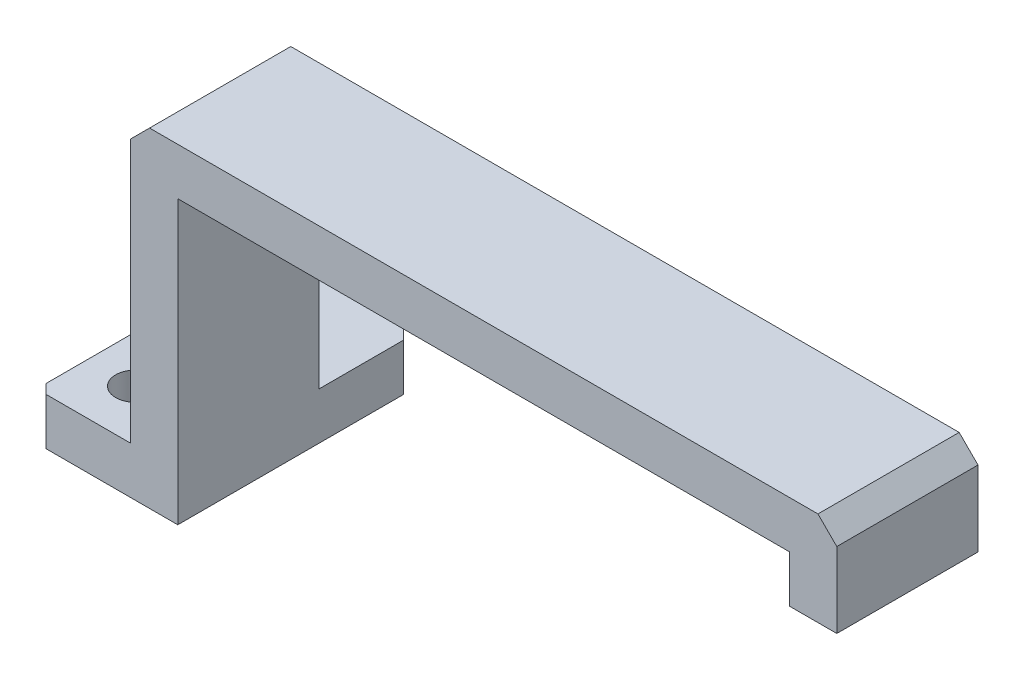
ISO-10303-21;
HEADER;
FILE_DESCRIPTION(('STEP AP214'),'2;1');
FILE_NAME('part.step','',(''),(''),'','','');
FILE_SCHEMA(('AUTOMOTIVE_DESIGN { 1 0 10303 214 1 1 1 1 }'));
ENDSEC;
DATA;
#1=APPLICATION_CONTEXT('core data for automotive mechanical design processes');
#2=APPLICATION_PROTOCOL_DEFINITION('international standard','automotive_design',2000,#1);
#3=PRODUCT_CONTEXT('',#1,'mechanical');
#4=PRODUCT('Part','Part','',(#3));
#5=PRODUCT_RELATED_PRODUCT_CATEGORY('part','',(#4));
#6=PRODUCT_DEFINITION_FORMATION('','',#4);
#7=PRODUCT_DEFINITION_CONTEXT('part definition',#1,'design');
#8=PRODUCT_DEFINITION('design','',#6,#7);
#9=PRODUCT_DEFINITION_SHAPE('','',#8);
#10=(LENGTH_UNIT() NAMED_UNIT(*) SI_UNIT(.MILLI.,.METRE.));
#11=(NAMED_UNIT(*) PLANE_ANGLE_UNIT() SI_UNIT($,.RADIAN.));
#12=(NAMED_UNIT(*) SI_UNIT($,.STERADIAN.) SOLID_ANGLE_UNIT());
#13=UNCERTAINTY_MEASURE_WITH_UNIT(LENGTH_MEASURE(1.E-05),#10,'distance_accuracy_value','');
#14=(GEOMETRIC_REPRESENTATION_CONTEXT(3) GLOBAL_UNCERTAINTY_ASSIGNED_CONTEXT((#13)) GLOBAL_UNIT_ASSIGNED_CONTEXT((#10,
#11,#12)) REPRESENTATION_CONTEXT('',''));
#15=CARTESIAN_POINT('',(0.,0.,0.));
#16=DIRECTION('',(0.,0.,1.));
#17=DIRECTION('',(1.,0.,0.));
#18=AXIS2_PLACEMENT_3D('',#15,#16,#17);
#19=CARTESIAN_POINT('',(0.,0.,0.));
#20=DIRECTION('',(0.,0.,1.));
#21=DIRECTION('',(1.,0.,0.));
#22=AXIS2_PLACEMENT_3D('',#19,#20,#21);
#23=PLANE('',#22);
#24=DIRECTION('',(-1.,0.,0.));
#25=VECTOR('',#24,1.);
#26=CARTESIAN_POINT('',(-21.3196601125011,-12.5,0.));
#27=LINE('',#26,#25);
#28=CARTESIAN_POINT('',(-32.5,-12.5,0.));
#29=VERTEX_POINT('',#28);
#30=CARTESIAN_POINT('',(-37.5,-12.5,0.));
#31=VERTEX_POINT('',#30);
#32=EDGE_CURVE('E156',#29,#31,#27,.T.);
#33=ORIENTED_EDGE('',*,*,#32,.T.);
#34=DIRECTION('',(0.,1.,0.));
#35=VECTOR('',#34,1.);
#36=CARTESIAN_POINT('',(-37.5,0.,0.));
#37=LINE('',#36,#35);
#38=CARTESIAN_POINT('',(-37.5,15.5,0.));
#39=VERTEX_POINT('',#38);
#40=EDGE_CURVE('E159',#31,#39,#37,.T.);
#41=ORIENTED_EDGE('',*,*,#40,.T.);
#42=DIRECTION('',(-0.707106781186546,-0.707106781186549,0.));
#43=VECTOR('',#42,1.);
#44=CARTESIAN_POINT('',(-37.5,15.5,0.));
#45=LINE('',#44,#43);
#46=CARTESIAN_POINT('',(-35.5,17.5,0.));
#47=VERTEX_POINT('',#46);
#48=EDGE_CURVE('E198',#39,#47,#45,.F.);
#49=ORIENTED_EDGE('',*,*,#48,.T.);
#50=DIRECTION('',(1.,0.,0.));
#51=VECTOR('',#50,1.);
#52=CARTESIAN_POINT('',(0.,17.5,0.));
#53=LINE('',#52,#51);
#54=CARTESIAN_POINT('',(35.5,17.5,0.));
#55=VERTEX_POINT('',#54);
#56=EDGE_CURVE('E179',#47,#55,#53,.T.);
#57=ORIENTED_EDGE('',*,*,#56,.T.);
#58=DIRECTION('',(0.707106781186546,-0.707106781186549,0.));
#59=VECTOR('',#58,1.);
#60=CARTESIAN_POINT('',(35.5,17.5,0.));
#61=LINE('',#60,#59);
#62=CARTESIAN_POINT('',(37.5,15.5,0.));
#63=VERTEX_POINT('',#62);
#64=EDGE_CURVE('E200',#55,#63,#61,.T.);
#65=ORIENTED_EDGE('',*,*,#64,.T.);
#66=DIRECTION('',(0.,1.,0.));
#67=VECTOR('',#66,1.);
#68=CARTESIAN_POINT('',(37.5,0.,0.));
#69=LINE('',#68,#67);
#70=CARTESIAN_POINT('',(37.5,7.5,0.));
#71=VERTEX_POINT('',#70);
#72=EDGE_CURVE('E182',#71,#63,#69,.T.);
#73=ORIENTED_EDGE('',*,*,#72,.F.);
#74=DIRECTION('',(-1.,0.,0.));
#75=VECTOR('',#74,1.);
#76=CARTESIAN_POINT('',(75.5,7.50000000000006,0.));
#77=LINE('',#76,#75);
#78=CARTESIAN_POINT('',(32.5,7.5,0.));
#79=VERTEX_POINT('',#78);
#80=EDGE_CURVE('E255',#71,#79,#77,.T.);
#81=ORIENTED_EDGE('',*,*,#80,.T.);
#82=DIRECTION('',(0.,1.,0.));
#83=VECTOR('',#82,1.);
#84=CARTESIAN_POINT('',(32.5,0.,0.));
#85=LINE('',#84,#83);
#86=CARTESIAN_POINT('',(32.5,12.5,0.));
#87=VERTEX_POINT('',#86);
#88=EDGE_CURVE('E291',#79,#87,#85,.T.);
#89=ORIENTED_EDGE('',*,*,#88,.T.);
#90=DIRECTION('',(1.,0.,0.));
#91=VECTOR('',#90,1.);
#92=CARTESIAN_POINT('',(0.,12.5,0.));
#93=LINE('',#92,#91);
#94=CARTESIAN_POINT('',(-32.5,12.5,0.));
#95=VERTEX_POINT('',#94);
#96=EDGE_CURVE('E288',#95,#87,#93,.T.);
#97=ORIENTED_EDGE('',*,*,#96,.F.);
#98=DIRECTION('',(0.,1.,0.));
#99=VECTOR('',#98,1.);
#100=CARTESIAN_POINT('',(-32.5,0.,0.));
#101=LINE('',#100,#99);
#102=EDGE_CURVE('E161',#29,#95,#101,.T.);
#103=ORIENTED_EDGE('',*,*,#102,.F.);
#104=EDGE_LOOP('',(#33,#41,#49,#57,#65,#73,#81,#89,#97,#103));
#105=FACE_BOUND('',#104,.T.);
#106=ADVANCED_FACE('F42',(#105),#23,.F.);
#107=CARTESIAN_POINT('',(0.,-17.5,30.));
#108=DIRECTION('',(0.,-1.,0.));
#109=DIRECTION('',(1.,0.,0.));
#110=AXIS2_PLACEMENT_3D('',#107,#108,#109);
#111=PLANE('',#110);
#112=CARTESIAN_POINT('',(-42.5,-17.5,-4.5));
#113=DIRECTION('',(0.,-1.,0.));
#114=DIRECTION('',(1.,0.,0.));
#115=AXIS2_PLACEMENT_3D('',#112,#113,#114);
#116=CIRCLE('',#115,2.1);
#117=CARTESIAN_POINT('',(-40.4,-17.5,-4.5));
#118=VERTEX_POINT('',#117);
#119=EDGE_CURVE('E249',#118,#118,#116,.T.);
#120=ORIENTED_EDGE('',*,*,#119,.F.);
#121=EDGE_LOOP('',(#120));
#122=FACE_BOUND('',#121,.T.);
#123=CARTESIAN_POINT('',(-42.5,-17.5,9.5));
#124=DIRECTION('',(0.,-1.,0.));
#125=DIRECTION('',(1.,0.,0.));
#126=AXIS2_PLACEMENT_3D('',#123,#124,#125);
#127=CIRCLE('',#126,2.1);
#128=CARTESIAN_POINT('',(-40.4,-17.5,9.5));
#129=VERTEX_POINT('',#128);
#130=EDGE_CURVE('E324',#129,#129,#127,.T.);
#131=ORIENTED_EDGE('',*,*,#130,.F.);
#132=EDGE_LOOP('',(#131));
#133=FACE_BOUND('',#132,.T.);
#134=DIRECTION('',(-1.,0.,0.));
#135=VECTOR('',#134,1.);
#136=CARTESIAN_POINT('',(-47.5,-17.5,-10.));
#137=LINE('',#136,#135);
#138=CARTESIAN_POINT('',(-33.5,-17.5,-10.));
#139=VERTEX_POINT('',#138);
#140=CARTESIAN_POINT('',(-46.5,-17.5,-10.));
#141=VERTEX_POINT('',#140);
#142=EDGE_CURVE('E236',#139,#141,#137,.T.);
#143=ORIENTED_EDGE('',*,*,#142,.F.);
#144=DIRECTION('',(0.707106781186543,0.,0.707106781186552));
#145=VECTOR('',#144,1.);
#146=CARTESIAN_POINT('',(3.24999999999976,-17.5,26.7500000000003));
#147=LINE('',#146,#145);
#148=CARTESIAN_POINT('',(-32.5,-17.5,-8.99999999999999));
#149=VERTEX_POINT('',#148);
#150=EDGE_CURVE('E65',#139,#149,#147,.T.);
#151=ORIENTED_EDGE('',*,*,#150,.T.);
#152=DIRECTION('',(0.,0.,-1.));
#153=VECTOR('',#152,1.);
#154=CARTESIAN_POINT('',(-32.5,-17.5,30.));
#155=LINE('',#154,#153);
#156=CARTESIAN_POINT('',(-32.5,-17.5,15.));
#157=VERTEX_POINT('',#156);
#158=EDGE_CURVE('E191',#157,#149,#155,.T.);
#159=ORIENTED_EDGE('',*,*,#158,.F.);
#160=DIRECTION('',(1.,0.,0.));
#161=VECTOR('',#160,1.);
#162=CARTESIAN_POINT('',(0.,-17.5,15.));
#163=LINE('',#162,#161);
#164=CARTESIAN_POINT('',(-46.5,-17.5,15.));
#165=VERTEX_POINT('',#164);
#166=EDGE_CURVE('E282',#165,#157,#163,.T.);
#167=ORIENTED_EDGE('',*,*,#166,.F.);
#168=DIRECTION('',(-0.707106781186548,0.,-0.707106781186548));
#169=VECTOR('',#168,1.);
#170=CARTESIAN_POINT('',(-15.75,-17.5,45.75));
#171=LINE('',#170,#169);
#172=CARTESIAN_POINT('',(-47.5,-17.5,14.));
#173=VERTEX_POINT('',#172);
#174=EDGE_CURVE('E222',#165,#173,#171,.T.);
#175=ORIENTED_EDGE('',*,*,#174,.T.);
#176=DIRECTION('',(0.,0.,-1.));
#177=VECTOR('',#176,1.);
#178=CARTESIAN_POINT('',(-47.5,-17.5,30.));
#179=LINE('',#178,#177);
#180=CARTESIAN_POINT('',(-47.5,-17.5,-8.99999999999999));
#181=VERTEX_POINT('',#180);
#182=EDGE_CURVE('E247',#173,#181,#179,.T.);
#183=ORIENTED_EDGE('',*,*,#182,.T.);
#184=DIRECTION('',(-0.707106781186543,0.,0.707106781186552));
#185=VECTOR('',#184,1.);
#186=CARTESIAN_POINT('',(-43.2500000000003,-17.5,-13.2499999999997));
#187=LINE('',#186,#185);
#188=EDGE_CURVE('E224',#181,#141,#187,.F.);
#189=ORIENTED_EDGE('',*,*,#188,.T.);
#190=EDGE_LOOP('',(#143,#151,#159,#167,#175,#183,#189));
#191=FACE_BOUND('',#190,.T.);
#192=ADVANCED_FACE('F240',(#122,#133,#191),#111,.T.);
#193=CARTESIAN_POINT('',(0.,-12.5,30.));
#194=DIRECTION('',(0.,-1.,0.));
#195=DIRECTION('',(0.,0.,-1.));
#196=AXIS2_PLACEMENT_3D('',#193,#194,#195);
#197=PLANE('',#196);
#198=CARTESIAN_POINT('',(-42.5,-12.5,-4.5));
#199=DIRECTION('',(0.,1.,0.));
#200=DIRECTION('',(0.,0.,1.));
#201=AXIS2_PLACEMENT_3D('',#198,#199,#200);
#202=CIRCLE('',#201,2.1);
#203=CARTESIAN_POINT('',(-42.5,-12.5,-2.4));
#204=VERTEX_POINT('',#203);
#205=EDGE_CURVE('E320',#204,#204,#202,.T.);
#206=ORIENTED_EDGE('',*,*,#205,.F.);
#207=EDGE_LOOP('',(#206));
#208=FACE_BOUND('',#207,.T.);
#209=CARTESIAN_POINT('',(-42.5,-12.5,9.5));
#210=DIRECTION('',(0.,1.,0.));
#211=DIRECTION('',(0.,0.,1.));
#212=AXIS2_PLACEMENT_3D('',#209,#210,#211);
#213=CIRCLE('',#212,2.1);
#214=CARTESIAN_POINT('',(-42.5,-12.5,11.6));
#215=VERTEX_POINT('',#214);
#216=EDGE_CURVE('E317',#215,#215,#213,.T.);
#217=ORIENTED_EDGE('',*,*,#216,.F.);
#218=EDGE_LOOP('',(#217));
#219=FACE_BOUND('',#218,.T.);
#220=DIRECTION('',(0.,0.,-1.));
#221=VECTOR('',#220,1.);
#222=CARTESIAN_POINT('',(-32.5,-12.5,0.));
#223=LINE('',#222,#221);
#224=CARTESIAN_POINT('',(-32.5,-12.5,-8.99999999999999));
#225=VERTEX_POINT('',#224);
#226=EDGE_CURVE('E163',#29,#225,#223,.T.);
#227=ORIENTED_EDGE('',*,*,#226,.T.);
#228=DIRECTION('',(-0.707106781186543,0.,-0.707106781186552));
#229=VECTOR('',#228,1.);
#230=CARTESIAN_POINT('',(-33.5,-12.5,-10.));
#231=LINE('',#230,#229);
#232=CARTESIAN_POINT('',(-33.5,-12.5,-10.));
#233=VERTEX_POINT('',#232);
#234=EDGE_CURVE('E11',#225,#233,#231,.T.);
#235=ORIENTED_EDGE('',*,*,#234,.T.);
#236=DIRECTION('',(-1.,0.,0.));
#237=VECTOR('',#236,1.);
#238=CARTESIAN_POINT('',(-47.5,-12.5,-10.));
#239=LINE('',#238,#237);
#240=CARTESIAN_POINT('',(-46.5,-12.5,-10.));
#241=VERTEX_POINT('',#240);
#242=EDGE_CURVE('E237',#233,#241,#239,.T.);
#243=ORIENTED_EDGE('',*,*,#242,.T.);
#244=DIRECTION('',(0.707106781186543,0.,-0.707106781186552));
#245=VECTOR('',#244,1.);
#246=CARTESIAN_POINT('',(-46.5,-12.5,-10.));
#247=LINE('',#246,#245);
#248=CARTESIAN_POINT('',(-47.5,-12.5,-8.99999999999999));
#249=VERTEX_POINT('',#248);
#250=EDGE_CURVE('E215',#241,#249,#247,.F.);
#251=ORIENTED_EDGE('',*,*,#250,.T.);
#252=DIRECTION('',(0.,0.,1.));
#253=VECTOR('',#252,1.);
#254=CARTESIAN_POINT('',(-47.5,-12.5,0.));
#255=LINE('',#254,#253);
#256=CARTESIAN_POINT('',(-47.5,-12.5,14.));
#257=VERTEX_POINT('',#256);
#258=EDGE_CURVE('E244',#249,#257,#255,.T.);
#259=ORIENTED_EDGE('',*,*,#258,.T.);
#260=DIRECTION('',(0.707106781186548,0.,0.707106781186548));
#261=VECTOR('',#260,1.);
#262=CARTESIAN_POINT('',(-47.5,-12.5,14.));
#263=LINE('',#262,#261);
#264=CARTESIAN_POINT('',(-46.5,-12.5,15.));
#265=VERTEX_POINT('',#264);
#266=EDGE_CURVE('E213',#257,#265,#263,.T.);
#267=ORIENTED_EDGE('',*,*,#266,.T.);
#268=DIRECTION('',(1.,0.,0.));
#269=VECTOR('',#268,1.);
#270=CARTESIAN_POINT('',(0.,-12.5,15.));
#271=LINE('',#270,#269);
#272=CARTESIAN_POINT('',(-37.5000000000001,-12.5,15.));
#273=VERTEX_POINT('',#272);
#274=EDGE_CURVE('E169',#265,#273,#271,.T.);
#275=ORIENTED_EDGE('',*,*,#274,.T.);
#276=DIRECTION('',(0.,0.,-1.));
#277=VECTOR('',#276,1.);
#278=CARTESIAN_POINT('',(-37.5000000000001,-12.5,30.));
#279=LINE('',#278,#277);
#280=EDGE_CURVE('E166',#273,#31,#279,.T.);
#281=ORIENTED_EDGE('',*,*,#280,.T.);
#282=ORIENTED_EDGE('',*,*,#32,.F.);
#283=EDGE_LOOP('',(#227,#235,#243,#251,#259,#267,#275,#281,#282));
#284=FACE_BOUND('',#283,.T.);
#285=ADVANCED_FACE('F167',(#208,#219,#284),#197,.F.);
#286=CARTESIAN_POINT('',(0.,0.,15.));
#287=DIRECTION('',(0.,0.,-1.));
#288=DIRECTION('',(-1.,0.,0.));
#289=AXIS2_PLACEMENT_3D('',#286,#287,#288);
#290=PLANE('',#289);
#291=ORIENTED_EDGE('',*,*,#274,.F.);
#292=DIRECTION('',(0.,-1.,0.));
#293=VECTOR('',#292,1.);
#294=CARTESIAN_POINT('',(-46.5,-17.5,15.));
#295=LINE('',#294,#293);
#296=EDGE_CURVE('E227',#265,#165,#295,.T.);
#297=ORIENTED_EDGE('',*,*,#296,.T.);
#298=ORIENTED_EDGE('',*,*,#166,.T.);
#299=DIRECTION('',(0.,-1.,0.));
#300=VECTOR('',#299,1.);
#301=CARTESIAN_POINT('',(-32.5,0.,15.));
#302=LINE('',#301,#300);
#303=CARTESIAN_POINT('',(-32.5,12.5,15.));
#304=VERTEX_POINT('',#303);
#305=EDGE_CURVE('E266',#304,#157,#302,.T.);
#306=ORIENTED_EDGE('',*,*,#305,.F.);
#307=DIRECTION('',(-1.,0.,0.));
#308=VECTOR('',#307,1.);
#309=CARTESIAN_POINT('',(0.,12.5,15.));
#310=LINE('',#309,#308);
#311=CARTESIAN_POINT('',(32.5,12.5,15.));
#312=VERTEX_POINT('',#311);
#313=EDGE_CURVE('E268',#312,#304,#310,.T.);
#314=ORIENTED_EDGE('',*,*,#313,.F.);
#315=DIRECTION('',(0.,-1.,0.));
#316=VECTOR('',#315,1.);
#317=CARTESIAN_POINT('',(32.5,0.,15.));
#318=LINE('',#317,#316);
#319=CARTESIAN_POINT('',(32.5,7.5,15.));
#320=VERTEX_POINT('',#319);
#321=EDGE_CURVE('E263',#312,#320,#318,.T.);
#322=ORIENTED_EDGE('',*,*,#321,.T.);
#323=DIRECTION('',(1.,0.,0.));
#324=VECTOR('',#323,1.);
#325=CARTESIAN_POINT('',(0.,7.49999999999995,15.));
#326=LINE('',#325,#324);
#327=CARTESIAN_POINT('',(37.5,7.49999999999999,15.));
#328=VERTEX_POINT('',#327);
#329=EDGE_CURVE('E207',#320,#328,#326,.T.);
#330=ORIENTED_EDGE('',*,*,#329,.T.);
#331=DIRECTION('',(0.,-1.,0.));
#332=VECTOR('',#331,1.);
#333=CARTESIAN_POINT('',(37.5,0.,15.));
#334=LINE('',#333,#332);
#335=CARTESIAN_POINT('',(37.5,15.5,15.));
#336=VERTEX_POINT('',#335);
#337=EDGE_CURVE('E273',#336,#328,#334,.T.);
#338=ORIENTED_EDGE('',*,*,#337,.F.);
#339=DIRECTION('',(-0.707106781186546,0.707106781186549,0.));
#340=VECTOR('',#339,1.);
#341=CARTESIAN_POINT('',(35.5,17.5,15.));
#342=LINE('',#341,#340);
#343=CARTESIAN_POINT('',(35.5,17.5,15.));
#344=VERTEX_POINT('',#343);
#345=EDGE_CURVE('E276',#336,#344,#342,.T.);
#346=ORIENTED_EDGE('',*,*,#345,.T.);
#347=DIRECTION('',(-1.,0.,0.));
#348=VECTOR('',#347,1.);
#349=CARTESIAN_POINT('',(0.,17.5,15.));
#350=LINE('',#349,#348);
#351=CARTESIAN_POINT('',(-35.5,17.5,15.));
#352=VERTEX_POINT('',#351);
#353=EDGE_CURVE('E264',#344,#352,#350,.T.);
#354=ORIENTED_EDGE('',*,*,#353,.T.);
#355=DIRECTION('',(0.707106781186546,0.707106781186549,0.));
#356=VECTOR('',#355,1.);
#357=CARTESIAN_POINT('',(-37.5,15.5,15.));
#358=LINE('',#357,#356);
#359=CARTESIAN_POINT('',(-37.5,15.5,15.));
#360=VERTEX_POINT('',#359);
#361=EDGE_CURVE('E267',#352,#360,#358,.F.);
#362=ORIENTED_EDGE('',*,*,#361,.T.);
#363=DIRECTION('',(0.,-1.,0.));
#364=VECTOR('',#363,1.);
#365=CARTESIAN_POINT('',(-37.5,0.,15.));
#366=LINE('',#365,#364);
#367=EDGE_CURVE('E280',#360,#273,#366,.T.);
#368=ORIENTED_EDGE('',*,*,#367,.T.);
#369=EDGE_LOOP('',(#291,#297,#298,#306,#314,#322,#330,#338,#346,#354,#362,#368));
#370=FACE_BOUND('',#369,.T.);
#371=ADVANCED_FACE('F303',(#370),#290,.F.);
#372=CARTESIAN_POINT('',(-32.5,0.,30.));
#373=DIRECTION('',(-1.,0.,0.));
#374=DIRECTION('',(0.,0.,1.));
#375=AXIS2_PLACEMENT_3D('',#372,#373,#374);
#376=PLANE('',#375);
#377=ORIENTED_EDGE('',*,*,#158,.T.);
#378=DIRECTION('',(0.,1.,0.));
#379=VECTOR('',#378,1.);
#380=CARTESIAN_POINT('',(-32.5,-12.5,-8.99999999999999));
#381=LINE('',#380,#379);
#382=EDGE_CURVE('E51',#149,#225,#381,.T.);
#383=ORIENTED_EDGE('',*,*,#382,.T.);
#384=ORIENTED_EDGE('',*,*,#226,.F.);
#385=ORIENTED_EDGE('',*,*,#102,.T.);
#386=DIRECTION('',(0.,0.,-1.));
#387=VECTOR('',#386,1.);
#388=CARTESIAN_POINT('',(-32.5,12.5,30.));
#389=LINE('',#388,#387);
#390=EDGE_CURVE('E188',#304,#95,#389,.T.);
#391=ORIENTED_EDGE('',*,*,#390,.F.);
#392=ORIENTED_EDGE('',*,*,#305,.T.);
#393=EDGE_LOOP('',(#377,#383,#384,#385,#391,#392));
#394=FACE_BOUND('',#393,.T.);
#395=ADVANCED_FACE('F316',(#394),#376,.F.);
#396=CARTESIAN_POINT('',(0.,12.5,30.));
#397=DIRECTION('',(0.,1.,0.));
#398=DIRECTION('',(0.,0.,1.));
#399=AXIS2_PLACEMENT_3D('',#396,#397,#398);
#400=PLANE('',#399);
#401=DIRECTION('',(0.,0.,-1.));
#402=VECTOR('',#401,1.);
#403=CARTESIAN_POINT('',(32.5,12.5,30.));
#404=LINE('',#403,#402);
#405=EDGE_CURVE('E173',#312,#87,#404,.T.);
#406=ORIENTED_EDGE('',*,*,#405,.F.);
#407=ORIENTED_EDGE('',*,*,#313,.T.);
#408=ORIENTED_EDGE('',*,*,#390,.T.);
#409=ORIENTED_EDGE('',*,*,#96,.T.);
#410=EDGE_LOOP('',(#406,#407,#408,#409));
#411=FACE_BOUND('',#410,.T.);
#412=ADVANCED_FACE('F314',(#411),#400,.F.);
#413=CARTESIAN_POINT('',(32.5,0.,30.));
#414=DIRECTION('',(-1.,0.,0.));
#415=DIRECTION('',(0.,0.,1.));
#416=AXIS2_PLACEMENT_3D('',#413,#414,#415);
#417=PLANE('',#416);
#418=DIRECTION('',(0.,0.,-1.));
#419=VECTOR('',#418,1.);
#420=CARTESIAN_POINT('',(32.5,7.5,30.));
#421=LINE('',#420,#419);
#422=EDGE_CURVE('E261',#320,#79,#421,.T.);
#423=ORIENTED_EDGE('',*,*,#422,.F.);
#424=ORIENTED_EDGE('',*,*,#321,.F.);
#425=ORIENTED_EDGE('',*,*,#405,.T.);
#426=ORIENTED_EDGE('',*,*,#88,.F.);
#427=EDGE_LOOP('',(#423,#424,#425,#426));
#428=FACE_BOUND('',#427,.T.);
#429=ADVANCED_FACE('F311',(#428),#417,.T.);
#430=CARTESIAN_POINT('',(37.5,0.,30.));
#431=DIRECTION('',(-1.,0.,0.));
#432=DIRECTION('',(0.,-1.,0.));
#433=AXIS2_PLACEMENT_3D('',#430,#431,#432);
#434=PLANE('',#433);
#435=ORIENTED_EDGE('',*,*,#337,.T.);
#436=DIRECTION('',(0.,0.,-1.));
#437=VECTOR('',#436,1.);
#438=CARTESIAN_POINT('',(37.5,7.50000000000001,30.));
#439=LINE('',#438,#437);
#440=EDGE_CURVE('E258',#328,#71,#439,.T.);
#441=ORIENTED_EDGE('',*,*,#440,.T.);
#442=ORIENTED_EDGE('',*,*,#72,.T.);
#443=DIRECTION('',(0.,0.,1.));
#444=VECTOR('',#443,1.);
#445=CARTESIAN_POINT('',(37.5,15.5,30.));
#446=LINE('',#445,#444);
#447=EDGE_CURVE('E203',#63,#336,#446,.T.);
#448=ORIENTED_EDGE('',*,*,#447,.T.);
#449=EDGE_LOOP('',(#435,#441,#442,#448));
#450=FACE_BOUND('',#449,.T.);
#451=ADVANCED_FACE('F294',(#450),#434,.F.);
#452=CARTESIAN_POINT('',(0.,17.5,30.));
#453=DIRECTION('',(0.,1.,0.));
#454=DIRECTION('',(0.,0.,1.));
#455=AXIS2_PLACEMENT_3D('',#452,#453,#454);
#456=PLANE('',#455);
#457=ORIENTED_EDGE('',*,*,#353,.F.);
#458=DIRECTION('',(0.,0.,-1.));
#459=VECTOR('',#458,1.);
#460=CARTESIAN_POINT('',(35.5,17.5,0.));
#461=LINE('',#460,#459);
#462=EDGE_CURVE('E196',#344,#55,#461,.T.);
#463=ORIENTED_EDGE('',*,*,#462,.T.);
#464=ORIENTED_EDGE('',*,*,#56,.F.);
#465=DIRECTION('',(0.,0.,1.));
#466=VECTOR('',#465,1.);
#467=CARTESIAN_POINT('',(-35.5,17.5,30.));
#468=LINE('',#467,#466);
#469=EDGE_CURVE('E193',#47,#352,#468,.T.);
#470=ORIENTED_EDGE('',*,*,#469,.T.);
#471=EDGE_LOOP('',(#457,#463,#464,#470));
#472=FACE_BOUND('',#471,.T.);
#473=ADVANCED_FACE('F386',(#472),#456,.T.);
#474=CARTESIAN_POINT('',(-37.5,0.,30.));
#475=DIRECTION('',(-1.,0.,0.));
#476=DIRECTION('',(0.,-1.,0.));
#477=AXIS2_PLACEMENT_3D('',#474,#475,#476);
#478=PLANE('',#477);
#479=ORIENTED_EDGE('',*,*,#367,.F.);
#480=DIRECTION('',(0.,0.,-1.));
#481=VECTOR('',#480,1.);
#482=CARTESIAN_POINT('',(-37.5,15.5,30.));
#483=LINE('',#482,#481);
#484=EDGE_CURVE('E177',#360,#39,#483,.T.);
#485=ORIENTED_EDGE('',*,*,#484,.T.);
#486=ORIENTED_EDGE('',*,*,#40,.F.);
#487=ORIENTED_EDGE('',*,*,#280,.F.);
#488=EDGE_LOOP('',(#479,#485,#486,#487));
#489=FACE_BOUND('',#488,.T.);
#490=ADVANCED_FACE('F175',(#489),#478,.T.);
#491=CARTESIAN_POINT('',(35.5,17.5,30.));
#492=DIRECTION('',(0.707106781186549,0.707106781186546,0.));
#493=DIRECTION('',(0.,0.,1.));
#494=AXIS2_PLACEMENT_3D('',#491,#492,#493);
#495=PLANE('',#494);
#496=ORIENTED_EDGE('',*,*,#345,.F.);
#497=ORIENTED_EDGE('',*,*,#447,.F.);
#498=ORIENTED_EDGE('',*,*,#64,.F.);
#499=ORIENTED_EDGE('',*,*,#462,.F.);
#500=EDGE_LOOP('',(#496,#497,#498,#499));
#501=FACE_BOUND('',#500,.T.);
#502=ADVANCED_FACE('F301',(#501),#495,.T.);
#503=CARTESIAN_POINT('',(-37.5,15.5,30.));
#504=DIRECTION('',(0.707106781186549,-0.707106781186546,0.));
#505=DIRECTION('',(0.,0.,-1.));
#506=AXIS2_PLACEMENT_3D('',#503,#504,#505);
#507=PLANE('',#506);
#508=ORIENTED_EDGE('',*,*,#361,.F.);
#509=ORIENTED_EDGE('',*,*,#469,.F.);
#510=ORIENTED_EDGE('',*,*,#48,.F.);
#511=ORIENTED_EDGE('',*,*,#484,.F.);
#512=EDGE_LOOP('',(#508,#509,#510,#511));
#513=FACE_BOUND('',#512,.T.);
#514=ADVANCED_FACE('F353',(#513),#507,.F.);
#515=CARTESIAN_POINT('',(75.5,7.50000000000006,0.));
#516=DIRECTION('',(0.,1.,0.));
#517=DIRECTION('',(-1.,0.,0.));
#518=AXIS2_PLACEMENT_3D('',#515,#516,#517);
#519=PLANE('',#518);
#520=ORIENTED_EDGE('',*,*,#422,.T.);
#521=ORIENTED_EDGE('',*,*,#80,.F.);
#522=ORIENTED_EDGE('',*,*,#440,.F.);
#523=ORIENTED_EDGE('',*,*,#329,.F.);
#524=EDGE_LOOP('',(#520,#521,#522,#523));
#525=FACE_BOUND('',#524,.T.);
#526=ADVANCED_FACE('F308',(#525),#519,.F.);
#527=CARTESIAN_POINT('',(-47.5,-22.5,0.));
#528=DIRECTION('',(-1.,0.,0.));
#529=DIRECTION('',(0.,0.,1.));
#530=AXIS2_PLACEMENT_3D('',#527,#528,#529);
#531=PLANE('',#530);
#532=ORIENTED_EDGE('',*,*,#258,.F.);
#533=DIRECTION('',(0.,-1.,0.));
#534=VECTOR('',#533,1.);
#535=CARTESIAN_POINT('',(-47.5,-22.5,-8.99999999999999));
#536=LINE('',#535,#534);
#537=EDGE_CURVE('E220',#249,#181,#536,.T.);
#538=ORIENTED_EDGE('',*,*,#537,.T.);
#539=ORIENTED_EDGE('',*,*,#182,.F.);
#540=DIRECTION('',(0.,1.,0.));
#541=VECTOR('',#540,1.);
#542=CARTESIAN_POINT('',(-47.5,-12.5,14.));
#543=LINE('',#542,#541);
#544=EDGE_CURVE('E217',#173,#257,#543,.T.);
#545=ORIENTED_EDGE('',*,*,#544,.T.);
#546=EDGE_LOOP('',(#532,#538,#539,#545));
#547=FACE_BOUND('',#546,.T.);
#548=ADVANCED_FACE('F381',(#547),#531,.T.);
#549=CARTESIAN_POINT('',(-47.5,-17.5,-10.));
#550=DIRECTION('',(0.,0.,-1.));
#551=DIRECTION('',(-1.,0.,0.));
#552=AXIS2_PLACEMENT_3D('',#549,#550,#551);
#553=PLANE('',#552);
#554=ORIENTED_EDGE('',*,*,#242,.F.);
#555=DIRECTION('',(0.,-1.,0.));
#556=VECTOR('',#555,1.);
#557=CARTESIAN_POINT('',(-33.5,-17.5,-10.));
#558=LINE('',#557,#556);
#559=EDGE_CURVE('E229',#233,#139,#558,.T.);
#560=ORIENTED_EDGE('',*,*,#559,.T.);
#561=ORIENTED_EDGE('',*,*,#142,.T.);
#562=DIRECTION('',(0.,1.,0.));
#563=VECTOR('',#562,1.);
#564=CARTESIAN_POINT('',(-46.5,-17.5,-10.));
#565=LINE('',#564,#563);
#566=EDGE_CURVE('E210',#141,#241,#565,.T.);
#567=ORIENTED_EDGE('',*,*,#566,.T.);
#568=EDGE_LOOP('',(#554,#560,#561,#567));
#569=FACE_BOUND('',#568,.T.);
#570=ADVANCED_FACE('F235',(#569),#553,.T.);
#571=CARTESIAN_POINT('',(-42.5,-42.5,9.5));
#572=DIRECTION('',(0.,1.,0.));
#573=DIRECTION('',(0.,0.,1.));
#574=AXIS2_PLACEMENT_3D('',#571,#572,#573);
#575=CYLINDRICAL_SURFACE('',#574,2.1);
#576=ORIENTED_EDGE('',*,*,#130,.T.);
#577=EDGE_LOOP('',(#576));
#578=FACE_BOUND('',#577,.T.);
#579=ORIENTED_EDGE('',*,*,#216,.T.);
#580=EDGE_LOOP('',(#579));
#581=FACE_BOUND('',#580,.T.);
#582=ADVANCED_FACE('F414',(#578,#581),#575,.F.);
#583=CARTESIAN_POINT('',(-42.5,-42.5,-4.5));
#584=DIRECTION('',(0.,1.,0.));
#585=DIRECTION('',(0.,0.,1.));
#586=AXIS2_PLACEMENT_3D('',#583,#584,#585);
#587=CYLINDRICAL_SURFACE('',#586,2.1);
#588=ORIENTED_EDGE('',*,*,#119,.T.);
#589=EDGE_LOOP('',(#588));
#590=FACE_BOUND('',#589,.T.);
#591=ORIENTED_EDGE('',*,*,#205,.T.);
#592=EDGE_LOOP('',(#591));
#593=FACE_BOUND('',#592,.T.);
#594=ADVANCED_FACE('F331',(#590,#593),#587,.F.);
#595=CARTESIAN_POINT('',(-46.5,-17.5,-10.));
#596=DIRECTION('',(0.707106781186552,0.,0.707106781186542));
#597=DIRECTION('',(0.,1.,0.));
#598=AXIS2_PLACEMENT_3D('',#595,#596,#597);
#599=PLANE('',#598);
#600=ORIENTED_EDGE('',*,*,#188,.F.);
#601=ORIENTED_EDGE('',*,*,#537,.F.);
#602=ORIENTED_EDGE('',*,*,#250,.F.);
#603=ORIENTED_EDGE('',*,*,#566,.F.);
#604=EDGE_LOOP('',(#600,#601,#602,#603));
#605=FACE_BOUND('',#604,.T.);
#606=ADVANCED_FACE('F360',(#605),#599,.F.);
#607=CARTESIAN_POINT('',(-47.5,-22.5,14.));
#608=DIRECTION('',(-0.707106781186547,0.,0.707106781186547));
#609=DIRECTION('',(0.,-1.,0.));
#610=AXIS2_PLACEMENT_3D('',#607,#608,#609);
#611=PLANE('',#610);
#612=ORIENTED_EDGE('',*,*,#174,.F.);
#613=ORIENTED_EDGE('',*,*,#296,.F.);
#614=ORIENTED_EDGE('',*,*,#266,.F.);
#615=ORIENTED_EDGE('',*,*,#544,.F.);
#616=EDGE_LOOP('',(#612,#613,#614,#615));
#617=FACE_BOUND('',#616,.T.);
#618=ADVANCED_FACE('F365',(#617),#611,.T.);
#619=CARTESIAN_POINT('',(-33.5,-17.5,-10.));
#620=DIRECTION('',(0.707106781186552,0.,-0.707106781186542));
#621=DIRECTION('',(0.,1.,0.));
#622=AXIS2_PLACEMENT_3D('',#619,#620,#621);
#623=PLANE('',#622);
#624=ORIENTED_EDGE('',*,*,#234,.F.);
#625=ORIENTED_EDGE('',*,*,#382,.F.);
#626=ORIENTED_EDGE('',*,*,#150,.F.);
#627=ORIENTED_EDGE('',*,*,#559,.F.);
#628=EDGE_LOOP('',(#624,#625,#626,#627));
#629=FACE_BOUND('',#628,.T.);
#630=ADVANCED_FACE('F45',(#629),#623,.T.);
#631=CLOSED_SHELL('',(#106,#192,#285,#371,#395,#412,#429,#451,#473,#490,#502,#514,#526,#548,
#570,#582,#594,#606,#618,#630));
#632=MANIFOLD_SOLID_BREP('B2',#631);
#633=ADVANCED_BREP_SHAPE_REPRESENTATION('',(#18,#632),#14);
#634=SHAPE_DEFINITION_REPRESENTATION(#9,#633);
ENDSEC;
END-ISO-10303-21;
